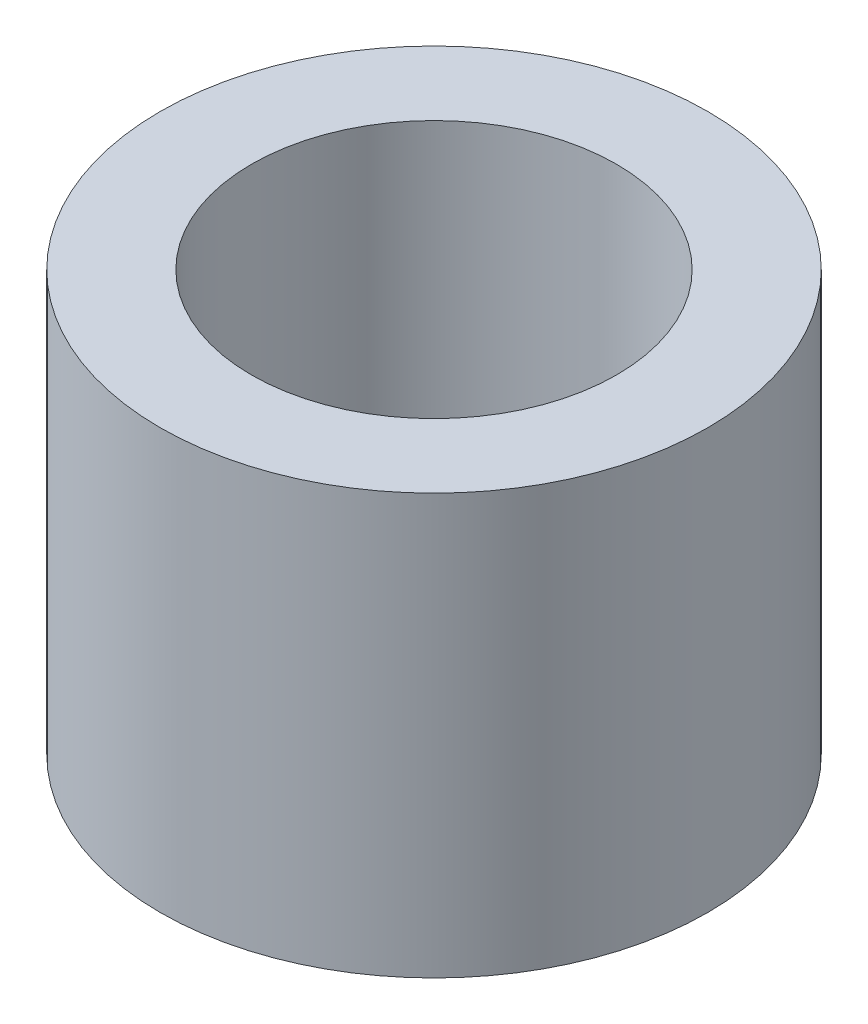
ISO-10303-21;
HEADER;
FILE_DESCRIPTION(('STEP AP214'),'2;1');
FILE_NAME('part.step','',(''),(''),'','','');
FILE_SCHEMA(('AUTOMOTIVE_DESIGN { 1 0 10303 214 1 1 1 1 }'));
ENDSEC;
DATA;
#1=APPLICATION_CONTEXT('core data for automotive mechanical design processes');
#2=APPLICATION_PROTOCOL_DEFINITION('international standard','automotive_design',2000,#1);
#3=PRODUCT_CONTEXT('',#1,'mechanical');
#4=PRODUCT('Part','Part','',(#3));
#5=PRODUCT_RELATED_PRODUCT_CATEGORY('part','',(#4));
#6=PRODUCT_DEFINITION_FORMATION('','',#4);
#7=PRODUCT_DEFINITION_CONTEXT('part definition',#1,'design');
#8=PRODUCT_DEFINITION('design','',#6,#7);
#9=PRODUCT_DEFINITION_SHAPE('','',#8);
#10=(LENGTH_UNIT() NAMED_UNIT(*) SI_UNIT(.MILLI.,.METRE.));
#11=(NAMED_UNIT(*) PLANE_ANGLE_UNIT() SI_UNIT($,.RADIAN.));
#12=(NAMED_UNIT(*) SI_UNIT($,.STERADIAN.) SOLID_ANGLE_UNIT());
#13=UNCERTAINTY_MEASURE_WITH_UNIT(LENGTH_MEASURE(1.E-05),#10,'distance_accuracy_value','');
#14=(GEOMETRIC_REPRESENTATION_CONTEXT(3) GLOBAL_UNCERTAINTY_ASSIGNED_CONTEXT((#13)) GLOBAL_UNIT_ASSIGNED_CONTEXT((#10,
#11,#12)) REPRESENTATION_CONTEXT('',''));
#15=CARTESIAN_POINT('',(0.,0.,0.));
#16=DIRECTION('',(0.,0.,1.));
#17=DIRECTION('',(1.,0.,0.));
#18=AXIS2_PLACEMENT_3D('',#15,#16,#17);
#19=CARTESIAN_POINT('',(0.,0.575,0.));
#20=DIRECTION('',(0.,1.,0.));
#21=DIRECTION('',(0.,0.,1.));
#22=AXIS2_PLACEMENT_3D('',#19,#20,#21);
#23=PLANE('',#22);
#24=CARTESIAN_POINT('',(0.,0.575,0.));
#25=DIRECTION('',(0.,1.,0.));
#26=DIRECTION('',(0.,0.,1.));
#27=AXIS2_PLACEMENT_3D('',#24,#25,#26);
#28=CIRCLE('',#27,0.75);
#29=CARTESIAN_POINT('',(0.,0.575,0.75));
#30=VERTEX_POINT('',#29);
#31=EDGE_CURVE('E10',#30,#30,#28,.T.);
#32=ORIENTED_EDGE('',*,*,#31,.T.);
#33=EDGE_LOOP('',(#32));
#34=FACE_BOUND('',#33,.T.);
#35=CARTESIAN_POINT('',(0.,0.575,0.));
#36=DIRECTION('',(0.,1.,0.));
#37=DIRECTION('',(0.,0.,1.));
#38=AXIS2_PLACEMENT_3D('',#35,#36,#37);
#39=CIRCLE('',#38,0.5);
#40=CARTESIAN_POINT('',(0.,0.575,0.5));
#41=VERTEX_POINT('',#40);
#42=EDGE_CURVE('E39',#41,#41,#39,.T.);
#43=ORIENTED_EDGE('',*,*,#42,.F.);
#44=EDGE_LOOP('',(#43));
#45=FACE_BOUND('',#44,.T.);
#46=ADVANCED_FACE('F28',(#34,#45),#23,.T.);
#47=CARTESIAN_POINT('',(0.,-0.575,0.));
#48=DIRECTION('',(0.,1.,0.));
#49=DIRECTION('',(0.,0.,1.));
#50=AXIS2_PLACEMENT_3D('',#47,#48,#49);
#51=PLANE('',#50);
#52=CARTESIAN_POINT('',(0.,-0.575,0.));
#53=DIRECTION('',(0.,1.,0.));
#54=DIRECTION('',(0.,0.,1.));
#55=AXIS2_PLACEMENT_3D('',#52,#53,#54);
#56=CIRCLE('',#55,0.75);
#57=CARTESIAN_POINT('',(0.,-0.575,0.75));
#58=VERTEX_POINT('',#57);
#59=EDGE_CURVE('E32',#58,#58,#56,.T.);
#60=ORIENTED_EDGE('',*,*,#59,.F.);
#61=EDGE_LOOP('',(#60));
#62=FACE_BOUND('',#61,.T.);
#63=CARTESIAN_POINT('',(0.,-0.575,0.));
#64=DIRECTION('',(0.,1.,0.));
#65=DIRECTION('',(0.,0.,1.));
#66=AXIS2_PLACEMENT_3D('',#63,#64,#65);
#67=CIRCLE('',#66,0.5);
#68=CARTESIAN_POINT('',(0.,-0.575,0.5));
#69=VERTEX_POINT('',#68);
#70=EDGE_CURVE('E41',#69,#69,#67,.T.);
#71=ORIENTED_EDGE('',*,*,#70,.T.);
#72=EDGE_LOOP('',(#71));
#73=FACE_BOUND('',#72,.T.);
#74=ADVANCED_FACE('F51',(#62,#73),#51,.F.);
#75=CARTESIAN_POINT('',(0.,0.575,0.));
#76=DIRECTION('',(0.,-1.,0.));
#77=DIRECTION('',(0.,0.,-1.));
#78=AXIS2_PLACEMENT_3D('',#75,#76,#77);
#79=CYLINDRICAL_SURFACE('',#78,0.75);
#80=ORIENTED_EDGE('',*,*,#31,.F.);
#81=EDGE_LOOP('',(#80));
#82=FACE_BOUND('',#81,.T.);
#83=ORIENTED_EDGE('',*,*,#59,.T.);
#84=EDGE_LOOP('',(#83));
#85=FACE_BOUND('',#84,.T.);
#86=ADVANCED_FACE('F30',(#82,#85),#79,.T.);
#87=CARTESIAN_POINT('',(0.,0.575,0.));
#88=DIRECTION('',(0.,-1.,0.));
#89=DIRECTION('',(0.,0.,-1.));
#90=AXIS2_PLACEMENT_3D('',#87,#88,#89);
#91=CYLINDRICAL_SURFACE('',#90,0.5);
#92=ORIENTED_EDGE('',*,*,#42,.T.);
#93=EDGE_LOOP('',(#92));
#94=FACE_BOUND('',#93,.T.);
#95=ORIENTED_EDGE('',*,*,#70,.F.);
#96=EDGE_LOOP('',(#95));
#97=FACE_BOUND('',#96,.T.);
#98=ADVANCED_FACE('F47',(#94,#97),#91,.F.);
#99=CLOSED_SHELL('',(#46,#74,#86,#98));
#100=MANIFOLD_SOLID_BREP('B2',#99);
#101=ADVANCED_BREP_SHAPE_REPRESENTATION('',(#18,#100),#14);
#102=SHAPE_DEFINITION_REPRESENTATION(#9,#101);
ENDSEC;
END-ISO-10303-21;
